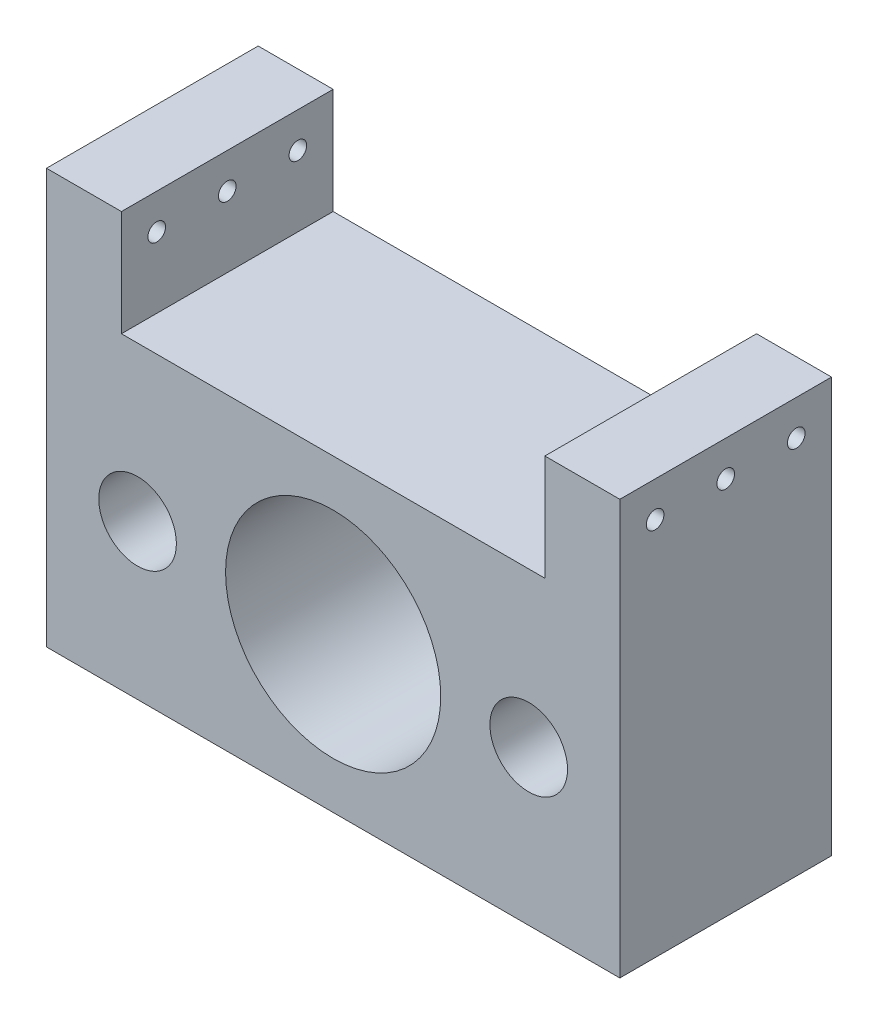
ISO-10303-21;
HEADER;
FILE_DESCRIPTION(('STEP AP214'),'2;1');
FILE_NAME('part.step','',(''),(''),'','','');
FILE_SCHEMA(('AUTOMOTIVE_DESIGN { 1 0 10303 214 1 1 1 1 }'));
ENDSEC;
DATA;
#1=APPLICATION_CONTEXT('core data for automotive mechanical design processes');
#2=APPLICATION_PROTOCOL_DEFINITION('international standard','automotive_design',2000,#1);
#3=PRODUCT_CONTEXT('',#1,'mechanical');
#4=PRODUCT('Part','Part','',(#3));
#5=PRODUCT_RELATED_PRODUCT_CATEGORY('part','',(#4));
#6=PRODUCT_DEFINITION_FORMATION('','',#4);
#7=PRODUCT_DEFINITION_CONTEXT('part definition',#1,'design');
#8=PRODUCT_DEFINITION('design','',#6,#7);
#9=PRODUCT_DEFINITION_SHAPE('','',#8);
#10=(LENGTH_UNIT() NAMED_UNIT(*) SI_UNIT(.MILLI.,.METRE.));
#11=(NAMED_UNIT(*) PLANE_ANGLE_UNIT() SI_UNIT($,.RADIAN.));
#12=(NAMED_UNIT(*) SI_UNIT($,.STERADIAN.) SOLID_ANGLE_UNIT());
#13=UNCERTAINTY_MEASURE_WITH_UNIT(LENGTH_MEASURE(1.E-05),#10,'distance_accuracy_value','');
#14=(GEOMETRIC_REPRESENTATION_CONTEXT(3) GLOBAL_UNCERTAINTY_ASSIGNED_CONTEXT((#13)) GLOBAL_UNIT_ASSIGNED_CONTEXT((#10,
#11,#12)) REPRESENTATION_CONTEXT('',''));
#15=CARTESIAN_POINT('',(0.,0.,0.));
#16=DIRECTION('',(0.,0.,1.));
#17=DIRECTION('',(1.,0.,0.));
#18=AXIS2_PLACEMENT_3D('',#15,#16,#17);
#19=CARTESIAN_POINT('',(22.1712802086963,0.,24.));
#20=DIRECTION('',(0.,0.,-1.));
#21=DIRECTION('',(-1.,0.,0.));
#22=AXIS2_PLACEMENT_3D('',#19,#20,#21);
#23=CYLINDRICAL_SURFACE('',#22,4.4);
#24=CARTESIAN_POINT('',(22.1712802086963,0.,24.));
#25=DIRECTION('',(0.,0.,1.));
#26=DIRECTION('',(1.,0.,0.));
#27=AXIS2_PLACEMENT_3D('',#24,#25,#26);
#28=CIRCLE('',#27,4.4);
#29=CARTESIAN_POINT('',(26.5712802086963,0.,24.));
#30=VERTEX_POINT('',#29);
#31=EDGE_CURVE('E201',#30,#30,#28,.F.);
#32=ORIENTED_EDGE('',*,*,#31,.F.);
#33=EDGE_LOOP('',(#32));
#34=FACE_BOUND('',#33,.T.);
#35=CARTESIAN_POINT('',(22.1712802086963,0.,0.));
#36=DIRECTION('',(0.,0.,1.));
#37=DIRECTION('',(1.,0.,0.));
#38=AXIS2_PLACEMENT_3D('',#35,#36,#37);
#39=CIRCLE('',#38,4.4);
#40=CARTESIAN_POINT('',(26.5712802086963,0.,0.));
#41=VERTEX_POINT('',#40);
#42=EDGE_CURVE('E187',#41,#41,#39,.F.);
#43=ORIENTED_EDGE('',*,*,#42,.T.);
#44=EDGE_LOOP('',(#43));
#45=FACE_BOUND('',#44,.T.);
#46=ADVANCED_FACE('F41',(#34,#45),#23,.F.);
#47=CARTESIAN_POINT('',(-22.1712802086963,0.,24.));
#48=DIRECTION('',(0.,0.,-1.));
#49=DIRECTION('',(-1.,0.,0.));
#50=AXIS2_PLACEMENT_3D('',#47,#48,#49);
#51=CYLINDRICAL_SURFACE('',#50,4.4);
#52=CARTESIAN_POINT('',(-22.1712802086963,0.,24.));
#53=DIRECTION('',(0.,0.,1.));
#54=DIRECTION('',(1.,0.,0.));
#55=AXIS2_PLACEMENT_3D('',#52,#53,#54);
#56=CIRCLE('',#55,4.4);
#57=CARTESIAN_POINT('',(-17.7712802086963,0.,24.));
#58=VERTEX_POINT('',#57);
#59=EDGE_CURVE('E198',#58,#58,#56,.T.);
#60=ORIENTED_EDGE('',*,*,#59,.T.);
#61=EDGE_LOOP('',(#60));
#62=FACE_BOUND('',#61,.T.);
#63=CARTESIAN_POINT('',(-22.1712802086963,0.,0.));
#64=DIRECTION('',(0.,0.,1.));
#65=DIRECTION('',(1.,0.,0.));
#66=AXIS2_PLACEMENT_3D('',#63,#64,#65);
#67=CIRCLE('',#66,4.4);
#68=CARTESIAN_POINT('',(-17.7712802086963,0.,0.));
#69=VERTEX_POINT('',#68);
#70=EDGE_CURVE('E210',#69,#69,#67,.T.);
#71=ORIENTED_EDGE('',*,*,#70,.F.);
#72=EDGE_LOOP('',(#71));
#73=FACE_BOUND('',#72,.T.);
#74=ADVANCED_FACE('F252',(#62,#73),#51,.F.);
#75=CARTESIAN_POINT('',(-32.5000000000004,0.,24.));
#76=DIRECTION('',(1.,0.,0.));
#77=DIRECTION('',(0.,1.,0.));
#78=AXIS2_PLACEMENT_3D('',#75,#76,#77);
#79=PLANE('',#78);
#80=CARTESIAN_POINT('',(-32.5000000000004,25.5,20.));
#81=DIRECTION('',(1.,0.,0.));
#82=DIRECTION('',(0.,0.,-1.));
#83=AXIS2_PLACEMENT_3D('',#80,#81,#82);
#84=CIRCLE('',#83,1.);
#85=CARTESIAN_POINT('',(-32.5000000000004,25.5,19.));
#86=VERTEX_POINT('',#85);
#87=EDGE_CURVE('E135',#86,#86,#84,.T.);
#88=ORIENTED_EDGE('',*,*,#87,.T.);
#89=EDGE_LOOP('',(#88));
#90=FACE_BOUND('',#89,.T.);
#91=CARTESIAN_POINT('',(-32.5000000000004,25.5,12.));
#92=DIRECTION('',(1.,0.,0.));
#93=DIRECTION('',(0.,0.,-1.));
#94=AXIS2_PLACEMENT_3D('',#91,#92,#93);
#95=CIRCLE('',#94,1.);
#96=CARTESIAN_POINT('',(-32.5000000000004,25.5,11.));
#97=VERTEX_POINT('',#96);
#98=EDGE_CURVE('E347',#97,#97,#95,.T.);
#99=ORIENTED_EDGE('',*,*,#98,.T.);
#100=EDGE_LOOP('',(#99));
#101=FACE_BOUND('',#100,.T.);
#102=CARTESIAN_POINT('',(-32.5000000000004,25.5,4.));
#103=DIRECTION('',(1.,0.,0.));
#104=DIRECTION('',(0.,0.,-1.));
#105=AXIS2_PLACEMENT_3D('',#102,#103,#104);
#106=CIRCLE('',#105,1.);
#107=CARTESIAN_POINT('',(-32.5000000000004,25.5,3.));
#108=VERTEX_POINT('',#107);
#109=EDGE_CURVE('E348',#108,#108,#106,.T.);
#110=ORIENTED_EDGE('',*,*,#109,.T.);
#111=EDGE_LOOP('',(#110));
#112=FACE_BOUND('',#111,.T.);
#113=DIRECTION('',(0.,-1.,0.));
#114=VECTOR('',#113,1.);
#115=CARTESIAN_POINT('',(-32.5000000000004,0.,0.));
#116=LINE('',#115,#114);
#117=CARTESIAN_POINT('',(-32.5000000000004,29.5,0.));
#118=VERTEX_POINT('',#117);
#119=CARTESIAN_POINT('',(-32.5000000000004,-17.5,0.));
#120=VERTEX_POINT('',#119);
#121=EDGE_CURVE('E205',#118,#120,#116,.T.);
#122=ORIENTED_EDGE('',*,*,#121,.T.);
#123=DIRECTION('',(0.,0.,-1.));
#124=VECTOR('',#123,1.);
#125=CARTESIAN_POINT('',(-32.5000000000004,-17.5,24.));
#126=LINE('',#125,#124);
#127=CARTESIAN_POINT('',(-32.5000000000004,-17.5,24.));
#128=VERTEX_POINT('',#127);
#129=EDGE_CURVE('E130',#128,#120,#126,.T.);
#130=ORIENTED_EDGE('',*,*,#129,.F.);
#131=DIRECTION('',(0.,-1.,0.));
#132=VECTOR('',#131,1.);
#133=CARTESIAN_POINT('',(-32.5000000000004,0.,24.));
#134=LINE('',#133,#132);
#135=CARTESIAN_POINT('',(-32.5000000000004,29.5,24.));
#136=VERTEX_POINT('',#135);
#137=EDGE_CURVE('E192',#136,#128,#134,.T.);
#138=ORIENTED_EDGE('',*,*,#137,.F.);
#139=DIRECTION('',(0.,0.,-1.));
#140=VECTOR('',#139,1.);
#141=CARTESIAN_POINT('',(-32.5000000000004,29.5,24.));
#142=LINE('',#141,#140);
#143=EDGE_CURVE('E109',#136,#118,#142,.T.);
#144=ORIENTED_EDGE('',*,*,#143,.T.);
#145=EDGE_LOOP('',(#122,#130,#138,#144));
#146=FACE_BOUND('',#145,.T.);
#147=ADVANCED_FACE('F258',(#90,#101,#112,#146),#79,.F.);
#148=CARTESIAN_POINT('',(0.,0.,24.));
#149=DIRECTION('',(0.,0.,-1.));
#150=DIRECTION('',(-1.,0.,0.));
#151=AXIS2_PLACEMENT_3D('',#148,#149,#150);
#152=CYLINDRICAL_SURFACE('',#151,12.1964405522279);
#153=CARTESIAN_POINT('',(0.,0.,5.));
#154=DIRECTION('',(0.,0.,1.));
#155=DIRECTION('',(1.,0.,0.));
#156=AXIS2_PLACEMENT_3D('',#153,#154,#155);
#157=CIRCLE('',#156,12.1964405522279);
#158=CARTESIAN_POINT('',(12.1964405522279,0.,5.));
#159=VERTEX_POINT('',#158);
#160=EDGE_CURVE('E11',#159,#159,#157,.T.);
#161=ORIENTED_EDGE('',*,*,#160,.F.);
#162=EDGE_LOOP('',(#161));
#163=FACE_BOUND('',#162,.T.);
#164=CARTESIAN_POINT('',(0.,0.,24.));
#165=DIRECTION('',(0.,0.,1.));
#166=DIRECTION('',(1.,0.,0.));
#167=AXIS2_PLACEMENT_3D('',#164,#165,#166);
#168=CIRCLE('',#167,12.1964405522279);
#169=CARTESIAN_POINT('',(12.1964405522279,0.,24.));
#170=VERTEX_POINT('',#169);
#171=EDGE_CURVE('E183',#170,#170,#168,.T.);
#172=ORIENTED_EDGE('',*,*,#171,.T.);
#173=EDGE_LOOP('',(#172));
#174=FACE_BOUND('',#173,.T.);
#175=ADVANCED_FACE('F269',(#163,#174),#152,.F.);
#176=CARTESIAN_POINT('',(0.,-17.5,24.));
#177=DIRECTION('',(0.,1.,0.));
#178=DIRECTION('',(0.,0.,1.));
#179=AXIS2_PLACEMENT_3D('',#176,#177,#178);
#180=PLANE('',#179);
#181=DIRECTION('',(1.,0.,0.));
#182=VECTOR('',#181,1.);
#183=CARTESIAN_POINT('',(0.,-17.5,0.));
#184=LINE('',#183,#182);
#185=CARTESIAN_POINT('',(32.4999999999996,-17.5,0.));
#186=VERTEX_POINT('',#185);
#187=EDGE_CURVE('E208',#120,#186,#184,.T.);
#188=ORIENTED_EDGE('',*,*,#187,.T.);
#189=DIRECTION('',(0.,0.,-1.));
#190=VECTOR('',#189,1.);
#191=CARTESIAN_POINT('',(32.4999999999996,-17.5,24.));
#192=LINE('',#191,#190);
#193=CARTESIAN_POINT('',(32.4999999999996,-17.5,24.));
#194=VERTEX_POINT('',#193);
#195=EDGE_CURVE('E103',#194,#186,#192,.T.);
#196=ORIENTED_EDGE('',*,*,#195,.F.);
#197=DIRECTION('',(1.,0.,0.));
#198=VECTOR('',#197,1.);
#199=CARTESIAN_POINT('',(0.,-17.5,24.));
#200=LINE('',#199,#198);
#201=EDGE_CURVE('E195',#128,#194,#200,.T.);
#202=ORIENTED_EDGE('',*,*,#201,.F.);
#203=ORIENTED_EDGE('',*,*,#129,.T.);
#204=EDGE_LOOP('',(#188,#196,#202,#203));
#205=FACE_BOUND('',#204,.T.);
#206=ADVANCED_FACE('F266',(#205),#180,.F.);
#207=CARTESIAN_POINT('',(0.,0.,0.));
#208=DIRECTION('',(0.,0.,1.));
#209=DIRECTION('',(1.,0.,0.));
#210=AXIS2_PLACEMENT_3D('',#207,#208,#209);
#211=PLANE('',#210);
#212=DIRECTION('',(0.,-1.,0.));
#213=VECTOR('',#212,1.);
#214=CARTESIAN_POINT('',(32.4999999999996,0.,0.));
#215=LINE('',#214,#213);
#216=CARTESIAN_POINT('',(32.5000000000004,29.5,0.));
#217=VERTEX_POINT('',#216);
#218=EDGE_CURVE('E95',#217,#186,#215,.T.);
#219=ORIENTED_EDGE('',*,*,#218,.T.);
#220=ORIENTED_EDGE('',*,*,#187,.F.);
#221=ORIENTED_EDGE('',*,*,#121,.F.);
#222=DIRECTION('',(1.,0.,0.));
#223=VECTOR('',#222,1.);
#224=CARTESIAN_POINT('',(-32.5000000000004,29.5,0.));
#225=LINE('',#224,#223);
#226=CARTESIAN_POINT('',(-24.,29.5,0.));
#227=VERTEX_POINT('',#226);
#228=EDGE_CURVE('E116',#118,#227,#225,.T.);
#229=ORIENTED_EDGE('',*,*,#228,.T.);
#230=DIRECTION('',(0.,1.,0.));
#231=VECTOR('',#230,1.);
#232=CARTESIAN_POINT('',(-24.0000000000004,17.5,0.));
#233=LINE('',#232,#231);
#234=CARTESIAN_POINT('',(-24.0000000000004,17.5,0.));
#235=VERTEX_POINT('',#234);
#236=EDGE_CURVE('E222',#235,#227,#233,.T.);
#237=ORIENTED_EDGE('',*,*,#236,.F.);
#238=DIRECTION('',(1.,0.,0.));
#239=VECTOR('',#238,1.);
#240=CARTESIAN_POINT('',(0.,17.5,0.));
#241=LINE('',#240,#239);
#242=CARTESIAN_POINT('',(24.0000000000004,17.5,0.));
#243=VERTEX_POINT('',#242);
#244=EDGE_CURVE('E108',#235,#243,#241,.T.);
#245=ORIENTED_EDGE('',*,*,#244,.T.);
#246=DIRECTION('',(0.,1.,0.));
#247=VECTOR('',#246,1.);
#248=CARTESIAN_POINT('',(24.0000000000004,17.5,0.));
#249=LINE('',#248,#247);
#250=CARTESIAN_POINT('',(24.,29.5,0.));
#251=VERTEX_POINT('',#250);
#252=EDGE_CURVE('E121',#243,#251,#249,.T.);
#253=ORIENTED_EDGE('',*,*,#252,.T.);
#254=DIRECTION('',(-1.,0.,0.));
#255=VECTOR('',#254,1.);
#256=CARTESIAN_POINT('',(32.5000000000004,29.5,0.));
#257=LINE('',#256,#255);
#258=EDGE_CURVE('E113',#217,#251,#257,.T.);
#259=ORIENTED_EDGE('',*,*,#258,.F.);
#260=EDGE_LOOP('',(#219,#220,#221,#229,#237,#245,#253,#259));
#261=FACE_BOUND('',#260,.T.);
#262=ORIENTED_EDGE('',*,*,#70,.T.);
#263=EDGE_LOOP('',(#262));
#264=FACE_BOUND('',#263,.T.);
#265=ORIENTED_EDGE('',*,*,#42,.F.);
#266=EDGE_LOOP('',(#265));
#267=FACE_BOUND('',#266,.T.);
#268=CARTESIAN_POINT('',(-8.,0.,0.));
#269=DIRECTION('',(0.,0.,1.));
#270=DIRECTION('',(1.,0.,0.));
#271=AXIS2_PLACEMENT_3D('',#268,#269,#270);
#272=CIRCLE('',#271,1.5);
#273=CARTESIAN_POINT('',(-6.5,0.,0.));
#274=VERTEX_POINT('',#273);
#275=EDGE_CURVE('E154',#274,#274,#272,.T.);
#276=ORIENTED_EDGE('',*,*,#275,.T.);
#277=EDGE_LOOP('',(#276));
#278=FACE_BOUND('',#277,.T.);
#279=CARTESIAN_POINT('',(0.,-8.,0.));
#280=DIRECTION('',(0.,0.,1.));
#281=DIRECTION('',(1.,0.,0.));
#282=AXIS2_PLACEMENT_3D('',#279,#280,#281);
#283=CIRCLE('',#282,1.5);
#284=CARTESIAN_POINT('',(1.49999999999994,-8.,0.));
#285=VERTEX_POINT('',#284);
#286=EDGE_CURVE('E172',#285,#285,#283,.T.);
#287=ORIENTED_EDGE('',*,*,#286,.T.);
#288=EDGE_LOOP('',(#287));
#289=FACE_BOUND('',#288,.T.);
#290=CARTESIAN_POINT('',(8.,0.,0.));
#291=DIRECTION('',(0.,0.,1.));
#292=DIRECTION('',(1.,0.,0.));
#293=AXIS2_PLACEMENT_3D('',#290,#291,#292);
#294=CIRCLE('',#293,1.5);
#295=CARTESIAN_POINT('',(9.5,0.,0.));
#296=VERTEX_POINT('',#295);
#297=EDGE_CURVE('E175',#296,#296,#294,.T.);
#298=ORIENTED_EDGE('',*,*,#297,.T.);
#299=EDGE_LOOP('',(#298));
#300=FACE_BOUND('',#299,.T.);
#301=CARTESIAN_POINT('',(0.,8.,0.));
#302=DIRECTION('',(0.,0.,1.));
#303=DIRECTION('',(1.,0.,0.));
#304=AXIS2_PLACEMENT_3D('',#301,#302,#303);
#305=CIRCLE('',#304,1.5);
#306=CARTESIAN_POINT('',(1.5,8.,0.));
#307=VERTEX_POINT('',#306);
#308=EDGE_CURVE('E178',#307,#307,#305,.T.);
#309=ORIENTED_EDGE('',*,*,#308,.T.);
#310=EDGE_LOOP('',(#309));
#311=FACE_BOUND('',#310,.T.);
#312=CARTESIAN_POINT('',(0.,0.,0.));
#313=DIRECTION('',(0.,0.,1.));
#314=DIRECTION('',(1.,0.,0.));
#315=AXIS2_PLACEMENT_3D('',#312,#313,#314);
#316=CIRCLE('',#315,5.);
#317=CARTESIAN_POINT('',(5.,0.,0.));
#318=VERTEX_POINT('',#317);
#319=EDGE_CURVE('E159',#318,#318,#316,.T.);
#320=ORIENTED_EDGE('',*,*,#319,.T.);
#321=EDGE_LOOP('',(#320));
#322=FACE_BOUND('',#321,.T.);
#323=ADVANCED_FACE('F118',(#261,#264,#267,#278,#289,#300,#311,#322),#211,.F.);
#324=CARTESIAN_POINT('',(0.,0.,24.));
#325=DIRECTION('',(0.,0.,1.));
#326=DIRECTION('',(1.,0.,0.));
#327=AXIS2_PLACEMENT_3D('',#324,#325,#326);
#328=PLANE('',#327);
#329=ORIENTED_EDGE('',*,*,#171,.F.);
#330=EDGE_LOOP('',(#329));
#331=FACE_BOUND('',#330,.T.);
#332=DIRECTION('',(0.,-1.,0.));
#333=VECTOR('',#332,1.);
#334=CARTESIAN_POINT('',(32.4999999999996,0.,24.));
#335=LINE('',#334,#333);
#336=CARTESIAN_POINT('',(32.5000000000004,29.5,24.));
#337=VERTEX_POINT('',#336);
#338=EDGE_CURVE('E186',#337,#194,#335,.T.);
#339=ORIENTED_EDGE('',*,*,#338,.F.);
#340=DIRECTION('',(-1.,0.,0.));
#341=VECTOR('',#340,1.);
#342=CARTESIAN_POINT('',(32.5000000000004,29.5,24.));
#343=LINE('',#342,#341);
#344=CARTESIAN_POINT('',(24.,29.5,24.));
#345=VERTEX_POINT('',#344);
#346=EDGE_CURVE('E115',#337,#345,#343,.T.);
#347=ORIENTED_EDGE('',*,*,#346,.T.);
#348=DIRECTION('',(0.,1.,0.));
#349=VECTOR('',#348,1.);
#350=CARTESIAN_POINT('',(24.0000000000004,17.5,24.));
#351=LINE('',#350,#349);
#352=CARTESIAN_POINT('',(24.0000000000004,17.5,24.));
#353=VERTEX_POINT('',#352);
#354=EDGE_CURVE('E122',#353,#345,#351,.T.);
#355=ORIENTED_EDGE('',*,*,#354,.F.);
#356=DIRECTION('',(1.,0.,0.));
#357=VECTOR('',#356,1.);
#358=CARTESIAN_POINT('',(0.,17.5,24.));
#359=LINE('',#358,#357);
#360=CARTESIAN_POINT('',(-24.0000000000004,17.5,24.));
#361=VERTEX_POINT('',#360);
#362=EDGE_CURVE('E189',#361,#353,#359,.T.);
#363=ORIENTED_EDGE('',*,*,#362,.F.);
#364=DIRECTION('',(0.,1.,0.));
#365=VECTOR('',#364,1.);
#366=CARTESIAN_POINT('',(-24.0000000000004,17.5,24.));
#367=LINE('',#366,#365);
#368=CARTESIAN_POINT('',(-24.,29.5,24.));
#369=VERTEX_POINT('',#368);
#370=EDGE_CURVE('E221',#361,#369,#367,.T.);
#371=ORIENTED_EDGE('',*,*,#370,.T.);
#372=DIRECTION('',(1.,0.,0.));
#373=VECTOR('',#372,1.);
#374=CARTESIAN_POINT('',(-32.5000000000004,29.5,24.));
#375=LINE('',#374,#373);
#376=EDGE_CURVE('E218',#136,#369,#375,.T.);
#377=ORIENTED_EDGE('',*,*,#376,.F.);
#378=ORIENTED_EDGE('',*,*,#137,.T.);
#379=ORIENTED_EDGE('',*,*,#201,.T.);
#380=EDGE_LOOP('',(#339,#347,#355,#363,#371,#377,#378,#379));
#381=FACE_BOUND('',#380,.T.);
#382=ORIENTED_EDGE('',*,*,#59,.F.);
#383=EDGE_LOOP('',(#382));
#384=FACE_BOUND('',#383,.T.);
#385=ORIENTED_EDGE('',*,*,#31,.T.);
#386=EDGE_LOOP('',(#385));
#387=FACE_BOUND('',#386,.T.);
#388=ADVANCED_FACE('F234',(#331,#381,#384,#387),#328,.T.);
#389=CARTESIAN_POINT('',(0.,17.5,24.));
#390=DIRECTION('',(0.,1.,0.));
#391=DIRECTION('',(0.,0.,1.));
#392=AXIS2_PLACEMENT_3D('',#389,#390,#391);
#393=PLANE('',#392);
#394=DIRECTION('',(0.,0.,-1.));
#395=VECTOR('',#394,1.);
#396=CARTESIAN_POINT('',(-24.0000000000004,17.5,24.));
#397=LINE('',#396,#395);
#398=EDGE_CURVE('E51',#361,#235,#397,.T.);
#399=ORIENTED_EDGE('',*,*,#398,.F.);
#400=ORIENTED_EDGE('',*,*,#362,.T.);
#401=DIRECTION('',(0.,0.,-1.));
#402=VECTOR('',#401,1.);
#403=CARTESIAN_POINT('',(24.0000000000004,17.5,24.));
#404=LINE('',#403,#402);
#405=EDGE_CURVE('E60',#353,#243,#404,.T.);
#406=ORIENTED_EDGE('',*,*,#405,.T.);
#407=ORIENTED_EDGE('',*,*,#244,.F.);
#408=EDGE_LOOP('',(#399,#400,#406,#407));
#409=FACE_BOUND('',#408,.T.);
#410=ADVANCED_FACE('F274',(#409),#393,.T.);
#411=CARTESIAN_POINT('',(32.4999999999996,0.,24.));
#412=DIRECTION('',(1.,0.,0.));
#413=DIRECTION('',(0.,0.,-1.));
#414=AXIS2_PLACEMENT_3D('',#411,#412,#413);
#415=PLANE('',#414);
#416=CARTESIAN_POINT('',(32.5000000000004,25.5,20.));
#417=DIRECTION('',(1.,0.,0.));
#418=DIRECTION('',(0.,0.,-1.));
#419=AXIS2_PLACEMENT_3D('',#416,#417,#418);
#420=CIRCLE('',#419,1.);
#421=CARTESIAN_POINT('',(32.5000000000004,25.5,19.));
#422=VERTEX_POINT('',#421);
#423=EDGE_CURVE('E356',#422,#422,#420,.T.);
#424=ORIENTED_EDGE('',*,*,#423,.F.);
#425=EDGE_LOOP('',(#424));
#426=FACE_BOUND('',#425,.T.);
#427=CARTESIAN_POINT('',(32.5000000000004,25.5,12.));
#428=DIRECTION('',(1.,0.,0.));
#429=DIRECTION('',(0.,0.,-1.));
#430=AXIS2_PLACEMENT_3D('',#427,#428,#429);
#431=CIRCLE('',#430,1.);
#432=CARTESIAN_POINT('',(32.5000000000004,25.5,11.));
#433=VERTEX_POINT('',#432);
#434=EDGE_CURVE('E350',#433,#433,#431,.T.);
#435=ORIENTED_EDGE('',*,*,#434,.F.);
#436=EDGE_LOOP('',(#435));
#437=FACE_BOUND('',#436,.T.);
#438=CARTESIAN_POINT('',(32.5000000000004,25.5,4.));
#439=DIRECTION('',(1.,0.,0.));
#440=DIRECTION('',(0.,0.,-1.));
#441=AXIS2_PLACEMENT_3D('',#438,#439,#440);
#442=CIRCLE('',#441,1.);
#443=CARTESIAN_POINT('',(32.5000000000004,25.5,3.));
#444=VERTEX_POINT('',#443);
#445=EDGE_CURVE('E148',#444,#444,#442,.T.);
#446=ORIENTED_EDGE('',*,*,#445,.F.);
#447=EDGE_LOOP('',(#446));
#448=FACE_BOUND('',#447,.T.);
#449=ORIENTED_EDGE('',*,*,#218,.F.);
#450=DIRECTION('',(0.,0.,-1.));
#451=VECTOR('',#450,1.);
#452=CARTESIAN_POINT('',(32.5000000000004,29.5,24.));
#453=LINE('',#452,#451);
#454=EDGE_CURVE('E99',#337,#217,#453,.T.);
#455=ORIENTED_EDGE('',*,*,#454,.F.);
#456=ORIENTED_EDGE('',*,*,#338,.T.);
#457=ORIENTED_EDGE('',*,*,#195,.T.);
#458=EDGE_LOOP('',(#449,#455,#456,#457));
#459=FACE_BOUND('',#458,.T.);
#460=ADVANCED_FACE('F97',(#426,#437,#448,#459),#415,.T.);
#461=CARTESIAN_POINT('',(32.5000000000004,29.5,24.));
#462=DIRECTION('',(0.,-1.,0.));
#463=DIRECTION('',(0.,0.,-1.));
#464=AXIS2_PLACEMENT_3D('',#461,#462,#463);
#465=PLANE('',#464);
#466=ORIENTED_EDGE('',*,*,#258,.T.);
#467=DIRECTION('',(0.,0.,-1.));
#468=VECTOR('',#467,1.);
#469=CARTESIAN_POINT('',(24.,29.5,24.));
#470=LINE('',#469,#468);
#471=EDGE_CURVE('E88',#345,#251,#470,.T.);
#472=ORIENTED_EDGE('',*,*,#471,.F.);
#473=ORIENTED_EDGE('',*,*,#346,.F.);
#474=ORIENTED_EDGE('',*,*,#454,.T.);
#475=EDGE_LOOP('',(#466,#472,#473,#474));
#476=FACE_BOUND('',#475,.T.);
#477=ADVANCED_FACE('F112',(#476),#465,.F.);
#478=CARTESIAN_POINT('',(24.0000000000004,17.5,24.));
#479=DIRECTION('',(-1.,0.,0.));
#480=DIRECTION('',(0.,-1.,0.));
#481=AXIS2_PLACEMENT_3D('',#478,#479,#480);
#482=PLANE('',#481);
#483=CARTESIAN_POINT('',(24.0000000000001,25.5,20.));
#484=DIRECTION('',(-1.,0.,0.));
#485=DIRECTION('',(0.,-1.,0.));
#486=AXIS2_PLACEMENT_3D('',#483,#484,#485);
#487=CIRCLE('',#486,1.);
#488=CARTESIAN_POINT('',(24.0000000000002,24.5,20.));
#489=VERTEX_POINT('',#488);
#490=EDGE_CURVE('E151',#489,#489,#487,.T.);
#491=ORIENTED_EDGE('',*,*,#490,.F.);
#492=EDGE_LOOP('',(#491));
#493=FACE_BOUND('',#492,.T.);
#494=CARTESIAN_POINT('',(24.0000000000001,25.5,12.));
#495=DIRECTION('',(-1.,0.,0.));
#496=DIRECTION('',(0.,-1.,0.));
#497=AXIS2_PLACEMENT_3D('',#494,#495,#496);
#498=CIRCLE('',#497,1.);
#499=CARTESIAN_POINT('',(24.0000000000002,24.5,12.));
#500=VERTEX_POINT('',#499);
#501=EDGE_CURVE('E138',#500,#500,#498,.T.);
#502=ORIENTED_EDGE('',*,*,#501,.F.);
#503=EDGE_LOOP('',(#502));
#504=FACE_BOUND('',#503,.T.);
#505=CARTESIAN_POINT('',(24.0000000000001,25.5,4.));
#506=DIRECTION('',(-1.,0.,0.));
#507=DIRECTION('',(0.,-1.,0.));
#508=AXIS2_PLACEMENT_3D('',#505,#506,#507);
#509=CIRCLE('',#508,1.);
#510=CARTESIAN_POINT('',(24.0000000000002,24.5,4.));
#511=VERTEX_POINT('',#510);
#512=EDGE_CURVE('E134',#511,#511,#509,.T.);
#513=ORIENTED_EDGE('',*,*,#512,.F.);
#514=EDGE_LOOP('',(#513));
#515=FACE_BOUND('',#514,.T.);
#516=ORIENTED_EDGE('',*,*,#252,.F.);
#517=ORIENTED_EDGE('',*,*,#405,.F.);
#518=ORIENTED_EDGE('',*,*,#354,.T.);
#519=ORIENTED_EDGE('',*,*,#471,.T.);
#520=EDGE_LOOP('',(#516,#517,#518,#519));
#521=FACE_BOUND('',#520,.T.);
#522=ADVANCED_FACE('F43',(#493,#504,#515,#521),#482,.T.);
#523=CARTESIAN_POINT('',(-32.5000000000004,29.5,24.));
#524=DIRECTION('',(0.,1.,0.));
#525=DIRECTION('',(0.,0.,1.));
#526=AXIS2_PLACEMENT_3D('',#523,#524,#525);
#527=PLANE('',#526);
#528=ORIENTED_EDGE('',*,*,#228,.F.);
#529=ORIENTED_EDGE('',*,*,#143,.F.);
#530=ORIENTED_EDGE('',*,*,#376,.T.);
#531=DIRECTION('',(0.,0.,-1.));
#532=VECTOR('',#531,1.);
#533=CARTESIAN_POINT('',(-24.,29.5,24.));
#534=LINE('',#533,#532);
#535=EDGE_CURVE('E224',#369,#227,#534,.T.);
#536=ORIENTED_EDGE('',*,*,#535,.T.);
#537=EDGE_LOOP('',(#528,#529,#530,#536));
#538=FACE_BOUND('',#537,.T.);
#539=ADVANCED_FACE('F238',(#538),#527,.T.);
#540=CARTESIAN_POINT('',(-24.0000000000004,17.5,24.));
#541=DIRECTION('',(-1.,0.,0.));
#542=DIRECTION('',(0.,-1.,0.));
#543=AXIS2_PLACEMENT_3D('',#540,#541,#542);
#544=PLANE('',#543);
#545=CARTESIAN_POINT('',(-24.0000000000001,25.5,20.));
#546=DIRECTION('',(-1.,0.,0.));
#547=DIRECTION('',(0.,-1.,0.));
#548=AXIS2_PLACEMENT_3D('',#545,#546,#547);
#549=CIRCLE('',#548,1.);
#550=CARTESIAN_POINT('',(-24.0000000000002,24.5,20.));
#551=VERTEX_POINT('',#550);
#552=EDGE_CURVE('E45',#551,#551,#549,.T.);
#553=ORIENTED_EDGE('',*,*,#552,.T.);
#554=EDGE_LOOP('',(#553));
#555=FACE_BOUND('',#554,.T.);
#556=CARTESIAN_POINT('',(-24.0000000000001,25.5,12.));
#557=DIRECTION('',(-1.,0.,0.));
#558=DIRECTION('',(0.,-1.,0.));
#559=AXIS2_PLACEMENT_3D('',#556,#557,#558);
#560=CIRCLE('',#559,1.);
#561=CARTESIAN_POINT('',(-24.0000000000002,24.5,12.));
#562=VERTEX_POINT('',#561);
#563=EDGE_CURVE('E136',#562,#562,#560,.T.);
#564=ORIENTED_EDGE('',*,*,#563,.T.);
#565=EDGE_LOOP('',(#564));
#566=FACE_BOUND('',#565,.T.);
#567=CARTESIAN_POINT('',(-24.0000000000001,25.5,4.));
#568=DIRECTION('',(-1.,0.,0.));
#569=DIRECTION('',(0.,-1.,0.));
#570=AXIS2_PLACEMENT_3D('',#567,#568,#569);
#571=CIRCLE('',#570,1.);
#572=CARTESIAN_POINT('',(-24.0000000000002,24.5,4.));
#573=VERTEX_POINT('',#572);
#574=EDGE_CURVE('E132',#573,#573,#571,.T.);
#575=ORIENTED_EDGE('',*,*,#574,.T.);
#576=EDGE_LOOP('',(#575));
#577=FACE_BOUND('',#576,.T.);
#578=ORIENTED_EDGE('',*,*,#236,.T.);
#579=ORIENTED_EDGE('',*,*,#535,.F.);
#580=ORIENTED_EDGE('',*,*,#370,.F.);
#581=ORIENTED_EDGE('',*,*,#398,.T.);
#582=EDGE_LOOP('',(#578,#579,#580,#581));
#583=FACE_BOUND('',#582,.T.);
#584=ADVANCED_FACE('F245',(#555,#566,#577,#583),#544,.F.);
#585=CARTESIAN_POINT('',(0.,0.,5.));
#586=DIRECTION('',(0.,0.,-1.));
#587=DIRECTION('',(-1.,0.,0.));
#588=AXIS2_PLACEMENT_3D('',#585,#586,#587);
#589=CYLINDRICAL_SURFACE('',#588,5.);
#590=CARTESIAN_POINT('',(0.,0.,5.));
#591=DIRECTION('',(0.,0.,1.));
#592=DIRECTION('',(1.,0.,0.));
#593=AXIS2_PLACEMENT_3D('',#590,#591,#592);
#594=CIRCLE('',#593,5.);
#595=CARTESIAN_POINT('',(5.,0.,5.));
#596=VERTEX_POINT('',#595);
#597=EDGE_CURVE('E125',#596,#596,#594,.T.);
#598=ORIENTED_EDGE('',*,*,#597,.T.);
#599=EDGE_LOOP('',(#598));
#600=FACE_BOUND('',#599,.T.);
#601=ORIENTED_EDGE('',*,*,#319,.F.);
#602=EDGE_LOOP('',(#601));
#603=FACE_BOUND('',#602,.T.);
#604=ADVANCED_FACE('F283',(#600,#603),#589,.F.);
#605=CARTESIAN_POINT('',(0.,8.,5.));
#606=DIRECTION('',(0.,0.,-1.));
#607=DIRECTION('',(-1.,0.,0.));
#608=AXIS2_PLACEMENT_3D('',#605,#606,#607);
#609=CYLINDRICAL_SURFACE('',#608,1.5);
#610=CARTESIAN_POINT('',(0.,8.,5.));
#611=DIRECTION('',(0.,0.,1.));
#612=DIRECTION('',(1.,0.,0.));
#613=AXIS2_PLACEMENT_3D('',#610,#611,#612);
#614=CIRCLE('',#613,1.5);
#615=CARTESIAN_POINT('',(1.5,8.,5.));
#616=VERTEX_POINT('',#615);
#617=EDGE_CURVE('E165',#616,#616,#614,.T.);
#618=ORIENTED_EDGE('',*,*,#617,.T.);
#619=EDGE_LOOP('',(#618));
#620=FACE_BOUND('',#619,.T.);
#621=ORIENTED_EDGE('',*,*,#308,.F.);
#622=EDGE_LOOP('',(#621));
#623=FACE_BOUND('',#622,.T.);
#624=ADVANCED_FACE('F289',(#620,#623),#609,.F.);
#625=CARTESIAN_POINT('',(8.,0.,5.));
#626=DIRECTION('',(0.,0.,-1.));
#627=DIRECTION('',(-1.,0.,0.));
#628=AXIS2_PLACEMENT_3D('',#625,#626,#627);
#629=CYLINDRICAL_SURFACE('',#628,1.5);
#630=CARTESIAN_POINT('',(8.,0.,5.));
#631=DIRECTION('',(0.,0.,1.));
#632=DIRECTION('',(1.,0.,0.));
#633=AXIS2_PLACEMENT_3D('',#630,#631,#632);
#634=CIRCLE('',#633,1.5);
#635=CARTESIAN_POINT('',(9.5,0.,5.));
#636=VERTEX_POINT('',#635);
#637=EDGE_CURVE('E162',#636,#636,#634,.T.);
#638=ORIENTED_EDGE('',*,*,#637,.T.);
#639=EDGE_LOOP('',(#638));
#640=FACE_BOUND('',#639,.T.);
#641=ORIENTED_EDGE('',*,*,#297,.F.);
#642=EDGE_LOOP('',(#641));
#643=FACE_BOUND('',#642,.T.);
#644=ADVANCED_FACE('F421',(#640,#643),#629,.F.);
#645=CARTESIAN_POINT('',(0.,-8.,5.));
#646=DIRECTION('',(0.,0.,-1.));
#647=DIRECTION('',(-1.,0.,0.));
#648=AXIS2_PLACEMENT_3D('',#645,#646,#647);
#649=CYLINDRICAL_SURFACE('',#648,1.5);
#650=CARTESIAN_POINT('',(0.,-8.,5.));
#651=DIRECTION('',(0.,0.,1.));
#652=DIRECTION('',(1.,0.,0.));
#653=AXIS2_PLACEMENT_3D('',#650,#651,#652);
#654=CIRCLE('',#653,1.5);
#655=CARTESIAN_POINT('',(1.49999999999994,-8.,5.));
#656=VERTEX_POINT('',#655);
#657=EDGE_CURVE('E158',#656,#656,#654,.T.);
#658=ORIENTED_EDGE('',*,*,#657,.T.);
#659=EDGE_LOOP('',(#658));
#660=FACE_BOUND('',#659,.T.);
#661=ORIENTED_EDGE('',*,*,#286,.F.);
#662=EDGE_LOOP('',(#661));
#663=FACE_BOUND('',#662,.T.);
#664=ADVANCED_FACE('F411',(#660,#663),#649,.F.);
#665=CARTESIAN_POINT('',(-8.,0.,5.));
#666=DIRECTION('',(0.,0.,-1.));
#667=DIRECTION('',(-1.,0.,0.));
#668=AXIS2_PLACEMENT_3D('',#665,#666,#667);
#669=CYLINDRICAL_SURFACE('',#668,1.5);
#670=CARTESIAN_POINT('',(-8.,0.,5.));
#671=DIRECTION('',(0.,0.,1.));
#672=DIRECTION('',(1.,0.,0.));
#673=AXIS2_PLACEMENT_3D('',#670,#671,#672);
#674=CIRCLE('',#673,1.5);
#675=CARTESIAN_POINT('',(-6.5,0.,5.));
#676=VERTEX_POINT('',#675);
#677=EDGE_CURVE('E155',#676,#676,#674,.T.);
#678=ORIENTED_EDGE('',*,*,#677,.T.);
#679=EDGE_LOOP('',(#678));
#680=FACE_BOUND('',#679,.T.);
#681=ORIENTED_EDGE('',*,*,#275,.F.);
#682=EDGE_LOOP('',(#681));
#683=FACE_BOUND('',#682,.T.);
#684=ADVANCED_FACE('F330',(#680,#683),#669,.F.);
#685=CARTESIAN_POINT('',(0.,0.,5.));
#686=DIRECTION('',(0.,0.,1.));
#687=DIRECTION('',(1.,0.,0.));
#688=AXIS2_PLACEMENT_3D('',#685,#686,#687);
#689=PLANE('',#688);
#690=ORIENTED_EDGE('',*,*,#677,.F.);
#691=EDGE_LOOP('',(#690));
#692=FACE_BOUND('',#691,.T.);
#693=ORIENTED_EDGE('',*,*,#657,.F.);
#694=EDGE_LOOP('',(#693));
#695=FACE_BOUND('',#694,.T.);
#696=ORIENTED_EDGE('',*,*,#637,.F.);
#697=EDGE_LOOP('',(#696));
#698=FACE_BOUND('',#697,.T.);
#699=ORIENTED_EDGE('',*,*,#617,.F.);
#700=EDGE_LOOP('',(#699));
#701=FACE_BOUND('',#700,.T.);
#702=ORIENTED_EDGE('',*,*,#597,.F.);
#703=EDGE_LOOP('',(#702));
#704=FACE_BOUND('',#703,.T.);
#705=ORIENTED_EDGE('',*,*,#160,.T.);
#706=EDGE_LOOP('',(#705));
#707=FACE_BOUND('',#706,.T.);
#708=ADVANCED_FACE('F318',(#692,#695,#698,#701,#704,#707),#689,.T.);
#709=CARTESIAN_POINT('',(-32.5000000000004,25.5,4.));
#710=DIRECTION('',(1.,0.,0.));
#711=DIRECTION('',(0.,0.,-1.));
#712=AXIS2_PLACEMENT_3D('',#709,#710,#711);
#713=CYLINDRICAL_SURFACE('',#712,1.);
#714=ORIENTED_EDGE('',*,*,#109,.F.);
#715=EDGE_LOOP('',(#714));
#716=FACE_BOUND('',#715,.T.);
#717=ORIENTED_EDGE('',*,*,#574,.F.);
#718=EDGE_LOOP('',(#717));
#719=FACE_BOUND('',#718,.T.);
#720=ADVANCED_FACE('F316',(#716,#719),#713,.F.);
#721=CARTESIAN_POINT('',(-32.5000000000004,25.5,12.));
#722=DIRECTION('',(1.,0.,0.));
#723=DIRECTION('',(0.,0.,-1.));
#724=AXIS2_PLACEMENT_3D('',#721,#722,#723);
#725=CYLINDRICAL_SURFACE('',#724,1.);
#726=ORIENTED_EDGE('',*,*,#98,.F.);
#727=EDGE_LOOP('',(#726));
#728=FACE_BOUND('',#727,.T.);
#729=ORIENTED_EDGE('',*,*,#563,.F.);
#730=EDGE_LOOP('',(#729));
#731=FACE_BOUND('',#730,.T.);
#732=ADVANCED_FACE('F317',(#728,#731),#725,.F.);
#733=CARTESIAN_POINT('',(-32.5000000000004,25.5,20.));
#734=DIRECTION('',(1.,0.,0.));
#735=DIRECTION('',(0.,0.,-1.));
#736=AXIS2_PLACEMENT_3D('',#733,#734,#735);
#737=CYLINDRICAL_SURFACE('',#736,1.);
#738=ORIENTED_EDGE('',*,*,#87,.F.);
#739=EDGE_LOOP('',(#738));
#740=FACE_BOUND('',#739,.T.);
#741=ORIENTED_EDGE('',*,*,#552,.F.);
#742=EDGE_LOOP('',(#741));
#743=FACE_BOUND('',#742,.T.);
#744=ADVANCED_FACE('F325',(#740,#743),#737,.F.);
#745=ORIENTED_EDGE('',*,*,#512,.T.);
#746=EDGE_LOOP('',(#745));
#747=FACE_BOUND('',#746,.T.);
#748=ORIENTED_EDGE('',*,*,#445,.T.);
#749=EDGE_LOOP('',(#748));
#750=FACE_BOUND('',#749,.T.);
#751=ADVANCED_FACE('F321',(#747,#750),#713,.F.);
#752=ORIENTED_EDGE('',*,*,#501,.T.);
#753=EDGE_LOOP('',(#752));
#754=FACE_BOUND('',#753,.T.);
#755=ORIENTED_EDGE('',*,*,#434,.T.);
#756=EDGE_LOOP('',(#755));
#757=FACE_BOUND('',#756,.T.);
#758=ADVANCED_FACE('F328',(#754,#757),#725,.F.);
#759=ORIENTED_EDGE('',*,*,#490,.T.);
#760=EDGE_LOOP('',(#759));
#761=FACE_BOUND('',#760,.T.);
#762=ORIENTED_EDGE('',*,*,#423,.T.);
#763=EDGE_LOOP('',(#762));
#764=FACE_BOUND('',#763,.T.);
#765=ADVANCED_FACE('F339',(#761,#764),#737,.F.);
#766=CLOSED_SHELL('',(#46,#74,#147,#175,#206,#323,#388,#410,#460,#477,#522,#539,#584,#604,#624,
#644,#664,#684,#708,#720,#732,#744,#751,#758,#765));
#767=MANIFOLD_SOLID_BREP('B2',#766);
#768=ADVANCED_BREP_SHAPE_REPRESENTATION('',(#18,#767),#14);
#769=SHAPE_DEFINITION_REPRESENTATION(#9,#768);
ENDSEC;
END-ISO-10303-21;
